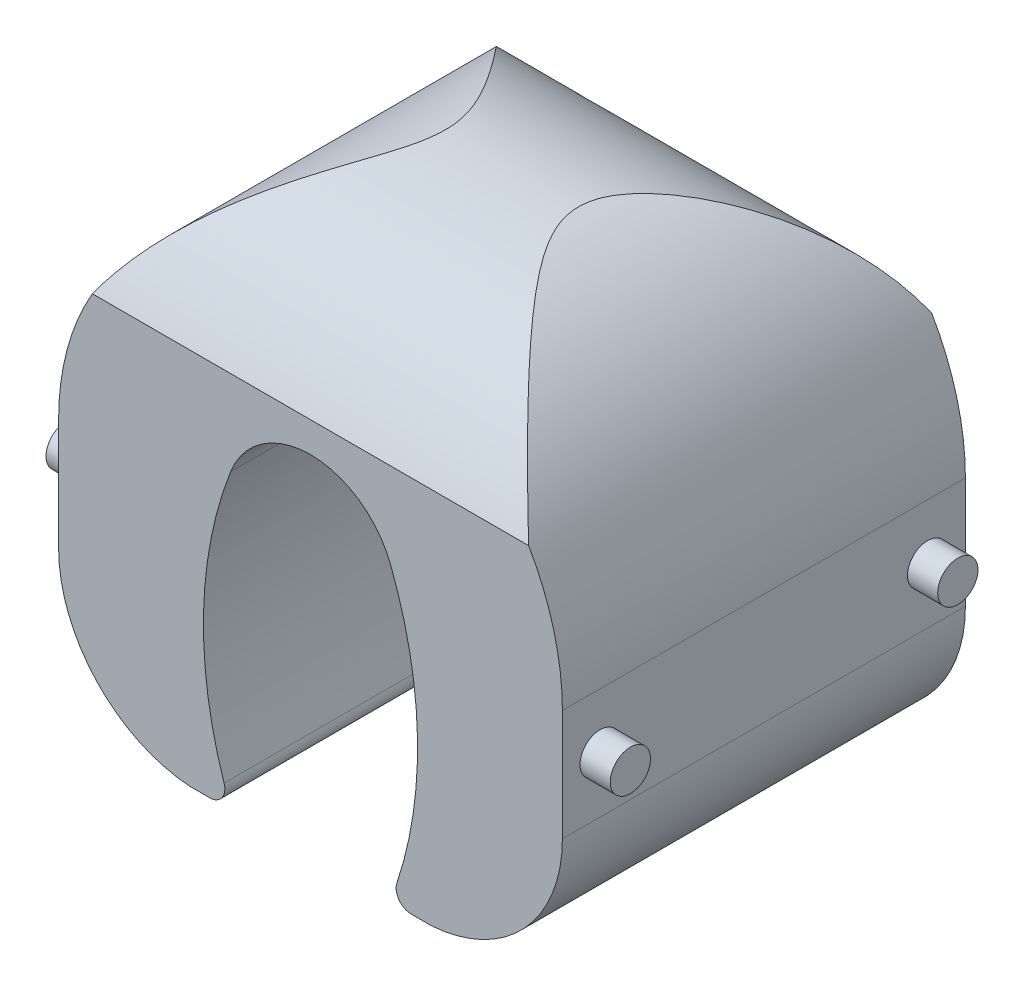
ISO-10303-21;
HEADER;
FILE_DESCRIPTION(('STEP AP214'),'2;1');
FILE_NAME('part.step','',(''),(''),'','','');
FILE_SCHEMA(('AUTOMOTIVE_DESIGN { 1 0 10303 214 1 1 1 1 }'));
ENDSEC;
DATA;
#1=APPLICATION_CONTEXT('core data for automotive mechanical design processes');
#2=APPLICATION_PROTOCOL_DEFINITION('international standard','automotive_design',2000,#1);
#3=PRODUCT_CONTEXT('',#1,'mechanical');
#4=PRODUCT('Part','Part','',(#3));
#5=PRODUCT_RELATED_PRODUCT_CATEGORY('part','',(#4));
#6=PRODUCT_DEFINITION_FORMATION('','',#4);
#7=PRODUCT_DEFINITION_CONTEXT('part definition',#1,'design');
#8=PRODUCT_DEFINITION('design','',#6,#7);
#9=PRODUCT_DEFINITION_SHAPE('','',#8);
#10=(LENGTH_UNIT() NAMED_UNIT(*) SI_UNIT(.MILLI.,.METRE.));
#11=(NAMED_UNIT(*) PLANE_ANGLE_UNIT() SI_UNIT($,.RADIAN.));
#12=(NAMED_UNIT(*) SI_UNIT($,.STERADIAN.) SOLID_ANGLE_UNIT());
#13=UNCERTAINTY_MEASURE_WITH_UNIT(LENGTH_MEASURE(1.E-05),#10,'distance_accuracy_value','');
#14=(GEOMETRIC_REPRESENTATION_CONTEXT(3) GLOBAL_UNCERTAINTY_ASSIGNED_CONTEXT((#13)) GLOBAL_UNIT_ASSIGNED_CONTEXT((#10,
#11,#12)) REPRESENTATION_CONTEXT('',''));
#15=CARTESIAN_POINT('',(0.,0.,0.));
#16=DIRECTION('',(0.,0.,1.));
#17=DIRECTION('',(1.,0.,0.));
#18=AXIS2_PLACEMENT_3D('',#15,#16,#17);
#19=CARTESIAN_POINT('',(0.,0.,-35.3553390593274));
#20=DIRECTION('',(0.,0.,1.));
#21=DIRECTION('',(1.,0.,0.));
#22=AXIS2_PLACEMENT_3D('',#19,#20,#21);
#23=CYLINDRICAL_SURFACE('',#22,25.);
#24=CARTESIAN_POINT('',(-21.650635094611,12.5,10.));
#25=CARTESIAN_POINT('',(-21.4703918887027,12.8122004030975,10.1679854247667));
#26=CARTESIAN_POINT('',(-21.2848264414583,13.1180055209978,10.342044413657));
#27=CARTESIAN_POINT('',(-20.9043958275241,13.7161056991821,10.7012859084175));
#28=CARTESIAN_POINT('',(-20.7095474527227,14.0084234018644,10.8864484751205));
#29=CARTESIAN_POINT('',(-20.3114243463407,14.5796837879489,11.2673071757743));
#30=CARTESIAN_POINT('',(-20.1081567166653,14.8586373326348,11.4629944717703));
#31=CARTESIAN_POINT('',(-19.6940313805674,15.4033160524038,11.8643222319061));
#32=CARTESIAN_POINT('',(-19.4831751193713,15.6690437235739,12.0699608034068));
#33=CARTESIAN_POINT('',(-19.0555450520767,16.1863647516528,12.4897826751679));
#34=CARTESIAN_POINT('',(-18.8387965942422,16.4380076864003,12.7039307822817));
#35=CARTESIAN_POINT('',(-18.3993892832232,16.9284052548925,13.1409722554456));
#36=CARTESIAN_POINT('',(-18.1767284439242,17.1671554738166,13.36386857257));
#37=CARTESIAN_POINT('',(-17.7263012157471,17.6318741285196,13.8178535965159));
#38=CARTESIAN_POINT('',(-17.4985334575103,17.8578390774432,14.0489445105173));
#39=CARTESIAN_POINT('',(-17.03871013725,18.2970887315882,14.5187715456033));
#40=CARTESIAN_POINT('',(-16.8066545293914,18.5103733011589,14.7575077484328));
#41=CARTESIAN_POINT('',(-16.2850388066385,18.9722229104713,15.2981079155009));
#42=CARTESIAN_POINT('',(-15.9945604410971,19.2175788516989,15.6018317271138));
#43=CARTESIAN_POINT('',(-15.4095501614137,19.6897705474217,16.2195543675952));
#44=CARTESIAN_POINT('',(-15.1150183002954,19.916606543908,16.5335530621318));
#45=CARTESIAN_POINT('',(-14.5231444741685,20.352231375241,17.1714610972733));
#46=CARTESIAN_POINT('',(-14.2258017546422,20.5610152024196,17.4953731543191));
#47=CARTESIAN_POINT('',(-13.6296829202574,20.9609304834307,18.1529011820612));
#48=CARTESIAN_POINT('',(-13.3309062956463,21.1520550810181,18.4865208562145));
#49=CARTESIAN_POINT('',(-12.7334517516285,21.5170114612812,19.163535537655));
#50=CARTESIAN_POINT('',(-12.4347739661515,21.690834122768,19.5069355795329));
#51=CARTESIAN_POINT('',(-11.8396264225496,22.0213322131252,20.2036187342451));
#52=CARTESIAN_POINT('',(-11.5431562409427,22.1780110140059,20.5568998863466));
#53=CARTESIAN_POINT('',(-10.9549209717684,22.474385583312,21.2740088675354));
#54=CARTESIAN_POINT('',(-10.663153262064,22.6140911218973,21.6378304785029));
#55=CARTESIAN_POINT('',(-10.231544981014,22.8109738078923,22.192537588075));
#56=CARTESIAN_POINT('',(-10.0887220907965,22.8744726865351,22.3788820662297));
#57=CARTESIAN_POINT('',(-9.80562711684787,22.9972492083998,22.7548664342805));
#58=CARTESIAN_POINT('',(-9.6653549576173,23.0565269767146,22.9445062263121));
#59=CARTESIAN_POINT('',(-9.33691362873108,23.1918981193467,23.3979610558075));
#60=CARTESIAN_POINT('',(-9.15014593432764,23.2661368144741,23.6633537405048));
#61=CARTESIAN_POINT('',(-8.78489185634464,23.4064934890057,24.2019352793417));
#62=CARTESIAN_POINT('',(-8.60640594500262,23.4726110056835,24.4751245766228));
#63=CARTESIAN_POINT('',(-8.26109111771411,23.5963548095124,25.0302761520533));
#64=CARTESIAN_POINT('',(-8.09424990031954,23.6539901308802,25.3122287031035));
#65=CARTESIAN_POINT('',(-7.77650340737462,23.7603451432342,25.8866370211786));
#66=CARTESIAN_POINT('',(-7.62559259699331,23.8090679351135,26.1790890926296));
#67=CARTESIAN_POINT('',(-7.39306884914248,23.8820442533476,26.675442980822));
#68=CARTESIAN_POINT('',(-7.30522751583686,23.9090140854946,26.8760190079123));
#69=CARTESIAN_POINT('',(-7.14167969006547,23.9583743142906,27.2827185563825));
#70=CARTESIAN_POINT('',(-7.06597565101058,23.9807637853254,27.4888431895381));
#71=CARTESIAN_POINT('',(-6.92961076346065,24.0205232899096,27.905944094508));
#72=CARTESIAN_POINT('',(-6.8689115245215,24.037906152329,28.1169064435606));
#73=CARTESIAN_POINT('',(-6.7651815848111,24.067306716289,28.5434214058895));
#74=CARTESIAN_POINT('',(-6.72213708903898,24.0793286074097,28.7589702962803));
#75=CARTESIAN_POINT('',(-6.66677972166271,24.0947000979095,29.1232883693034));
#76=CARTESIAN_POINT('',(-6.64903295077554,24.0995961122563,29.2711792952149));
#77=CARTESIAN_POINT('',(-6.62327901514955,24.1066870371467,29.5679023072381));
#78=CARTESIAN_POINT('',(-6.61527279621822,24.1088816853879,29.716734483335));
#79=CARTESIAN_POINT('',(-6.60926827480034,24.1105284464378,30.0145819627366));
#80=CARTESIAN_POINT('',(-6.61126771425774,24.1099811780365,30.163597217136));
#81=CARTESIAN_POINT('',(-6.62520639948135,24.1061546380479,30.4612201479508));
#82=CARTESIAN_POINT('',(-6.63715215020732,24.1028735785404,30.6098274937599));
#83=CARTESIAN_POINT('',(-6.67061882716562,24.093632846852,30.9059012379284));
#84=CARTESIAN_POINT('',(-6.69214182545653,24.0876725950191,31.0533673823584));
#85=CARTESIAN_POINT('',(-6.74412651410241,24.0731693111059,31.346572175449));
#86=CARTESIAN_POINT('',(-6.77458873237057,24.0646261264875,31.4923107215558));
#87=CARTESIAN_POINT('',(-6.87198975398278,24.0370554551266,31.9002719019654));
#88=CARTESIAN_POINT('',(-6.94836323598122,24.0151735321961,32.160077583654));
#89=CARTESIAN_POINT('',(-7.12283619094984,23.9640026450687,32.6714317547062));
#90=CARTESIAN_POINT('',(-7.22094432203518,23.9347107283991,32.9229769074622));
#91=CARTESIAN_POINT('',(-7.43448142943973,23.8692482739429,33.4189936782991));
#92=CARTESIAN_POINT('',(-7.54998886441732,23.8330463686048,33.6634269435672));
#93=CARTESIAN_POINT('',(-7.79395153146414,23.7543836221868,34.1445951402686));
#94=CARTESIAN_POINT('',(-7.92240528383555,23.7119234961336,34.3813309474005));
#95=CARTESIAN_POINT('',(-8.15126746077333,23.6340227936245,34.7816343329987));
#96=CARTESIAN_POINT('',(-8.24926986092713,23.6000172615012,34.9468734222186));
#97=CARTESIAN_POINT('',(-8.44946913232335,23.5290832607685,35.2741588904229));
#98=CARTESIAN_POINT('',(-8.55166624534764,23.4921546235582,35.4362050845709));
#99=CARTESIAN_POINT('',(-8.86359886487007,23.3770329497007,35.9182584060899));
#100=CARTESIAN_POINT('',(-9.07851338459997,23.2945587623321,36.2339019815985));
#101=CARTESIAN_POINT('',(-9.51796769199328,23.1184878071047,36.8557139182406));
#102=CARTESIAN_POINT('',(-9.74251834423342,23.0248782618574,37.1618708763069));
#103=CARTESIAN_POINT('',(-10.1981196665355,22.8267406379357,37.7657987339849));
#104=CARTESIAN_POINT('',(-10.4291718490069,22.7222100031568,38.0635676495589));
#105=CARTESIAN_POINT('',(-10.8962885745889,22.5019510003868,38.6524955322818));
#106=CARTESIAN_POINT('',(-11.1323661522503,22.3861897554257,38.9436318111285));
#107=CARTESIAN_POINT('',(-11.6070433616396,22.1437917737761,39.5187618245729));
#108=CARTESIAN_POINT('',(-11.8456405954942,22.0171646807473,39.8027616093276));
#109=CARTESIAN_POINT('',(-12.3242128372817,21.7528956921303,40.3641707608432));
#110=CARTESIAN_POINT('',(-12.5641872208421,21.6152584705892,40.6415828600407));
#111=CARTESIAN_POINT('',(-13.0445884657629,21.3287819521825,41.1901416774371));
#112=CARTESIAN_POINT('',(-13.2850153195066,21.1799428422724,41.4612885001025));
#113=CARTESIAN_POINT('',(-13.8646470920953,20.807075629001,42.1080790349915));
#114=CARTESIAN_POINT('',(-14.2036544081563,20.577373952853,42.4806503793502));
#115=CARTESIAN_POINT('',(-14.8787750975946,20.0946347764815,43.2133177049096));
#116=CARTESIAN_POINT('',(-15.214887644119,19.8415908357412,43.5734102050614));
#117=CARTESIAN_POINT('',(-15.8822419170561,19.3115512229187,44.280501674385));
#118=CARTESIAN_POINT('',(-16.2134823651142,19.034549391392,44.6274972432732));
#119=CARTESIAN_POINT('',(-16.8674034606368,18.4575164036212,45.3056635058732));
#120=CARTESIAN_POINT('',(-17.1901186525971,18.1576074494056,45.6369047114865));
#121=CARTESIAN_POINT('',(-17.8266551978411,17.5330853028519,46.2841624818673));
#122=CARTESIAN_POINT('',(-18.1404785554622,17.2084777396951,46.6001824891189));
#123=CARTESIAN_POINT('',(-18.7570007695802,16.534314370914,47.2154669536528));
#124=CARTESIAN_POINT('',(-19.059705444701,16.1847719043322,47.5147402190261));
#125=CARTESIAN_POINT('',(-19.767789615777,15.3185437730352,48.2086676375781));
#126=CARTESIAN_POINT('',(-20.1670613000592,14.7899244077552,48.59488747896));
#127=CARTESIAN_POINT('',(-20.7422488157644,13.959693540469,49.1446611549998));
#128=CARTESIAN_POINT('',(-20.9303060745223,13.6762500420653,49.3232546398173));
#129=CARTESIAN_POINT('',(-21.2974339565751,13.0972064374575,49.669779000776));
#130=CARTESIAN_POINT('',(-21.4765030730937,12.8016043079873,49.8377080903761));
#131=CARTESIAN_POINT('',(-21.6506350946109,12.5,50.));
#132=B_SPLINE_CURVE_WITH_KNOTS('',3,(#24,#25,#26,#27,#28,#29,#30,#31,#32,#33,#34,#35,#36,#37,
#38,#39,#40,#41,#42,#43,#44,#45,#46,#47,#48,#49,#50,#51,#52,#53,#54,#55,#56,#57,#58,#59,#60,#61,
#62,#63,#64,#65,#66,#67,#68,#69,#70,#71,#72,#73,#74,#75,#76,#77,#78,#79,#80,#81,#82,#83,#84,#85,
#86,#87,#88,#89,#90,#91,#92,#93,#94,#95,#96,#97,#98,#99,#100,#101,#102,#103,#104,#105,#106,#107,
#108,#109,#110,#111,#112,#113,#114,#115,#116,#117,#118,#119,#120,#121,#122,#123,#124,#125,#126,
#127,#128,#129,#130,#131),.UNSPECIFIED.,.F.,.F.,(4,2,2,2,2,2,2,2,2,2,2,2,2,2,2,2,2,2,2,2,2,2,2,
2,2,2,2,2,2,2,2,2,2,2,2,2,2,2,2,2,2,2,2,2,2,2,2,2,2,2,2,2,2,4),(0.,1.19294408488821,
2.38380662307588,3.57368431171742,4.76333657945521,5.94849716558415,7.1340610428383,
8.31994670906994,9.50584505924323,10.9652694174802,12.4246747030782,13.8844835371932,
15.3448567852579,16.805995876284,18.2668470586163,19.7268533202357,20.456446140872,
21.1860173309391,22.1844835110307,23.1830065551117,24.1804582735959,25.1775622907189,
25.8390676582252,26.5007065731094,27.1606347148178,27.8200462173023,28.2668314611608,
28.7136600843996,29.1603878728372,29.6074080541887,30.054524996399,30.5016683487935,
31.3152476282979,32.12915158615,32.9468420858645,33.7644392334973,34.3496508512963,
34.9348962479991,36.1063658039158,37.2791927826692,38.4522948816608,39.6289412119304,
40.8045538371358,41.9796700102416,43.1547665754334,44.8149845847803,46.4756620537792,
48.1367677503842,49.7895595257119,51.4419757270547,53.0935144954534,55.390507529612,
56.5426921094912,57.6950692014028),.UNSPECIFIED.);
#133=CARTESIAN_POINT('',(-21.650635094611,12.5,10.));
#134=VERTEX_POINT('',#133);
#135=CARTESIAN_POINT('',(-21.650635094611,12.5,50.));
#136=VERTEX_POINT('',#135);
#137=EDGE_CURVE('E302',#134,#136,#132,.T.);
#138=ORIENTED_EDGE('',*,*,#137,.F.);
#139=CARTESIAN_POINT('',(0.,0.,10.));
#140=DIRECTION('',(0.,0.,-1.));
#141=DIRECTION('',(-1.,0.,0.));
#142=AXIS2_PLACEMENT_3D('',#139,#140,#141);
#143=CIRCLE('',#142,25.);
#144=CARTESIAN_POINT('',(-25.,0.,10.));
#145=VERTEX_POINT('',#144);
#146=EDGE_CURVE('E273',#145,#134,#143,.T.);
#147=ORIENTED_EDGE('',*,*,#146,.F.);
#148=DIRECTION('',(0.,0.,1.));
#149=VECTOR('',#148,1.);
#150=CARTESIAN_POINT('',(-25.,0.,-35.3553390593274));
#151=LINE('',#150,#149);
#152=CARTESIAN_POINT('',(-25.,0.,50.));
#153=VERTEX_POINT('',#152);
#154=EDGE_CURVE('E213',#145,#153,#151,.T.);
#155=ORIENTED_EDGE('',*,*,#154,.T.);
#156=CARTESIAN_POINT('',(0.,0.,50.));
#157=DIRECTION('',(0.,0.,1.));
#158=DIRECTION('',(1.,0.,0.));
#159=AXIS2_PLACEMENT_3D('',#156,#157,#158);
#160=CIRCLE('',#159,25.);
#161=EDGE_CURVE('E294',#136,#153,#160,.T.);
#162=ORIENTED_EDGE('',*,*,#161,.F.);
#163=EDGE_LOOP('',(#138,#147,#155,#162));
#164=FACE_BOUND('',#163,.T.);
#165=ADVANCED_FACE('F65',(#164),#23,.T.);
#166=CARTESIAN_POINT('',(21.650635094611,12.5,10.));
#167=CARTESIAN_POINT('',(21.4703918887027,12.8122004030975,10.1679854247667));
#168=CARTESIAN_POINT('',(21.2848264414583,13.1180055209978,10.342044413657));
#169=CARTESIAN_POINT('',(20.9043958275241,13.7161056991821,10.7012859084175));
#170=CARTESIAN_POINT('',(20.7095474527227,14.0084234018644,10.8864484751205));
#171=CARTESIAN_POINT('',(20.3114243463407,14.5796837879489,11.2673071757743));
#172=CARTESIAN_POINT('',(20.1081567166653,14.8586373326348,11.4629944717703));
#173=CARTESIAN_POINT('',(19.6940313805674,15.4033160524038,11.8643222319061));
#174=CARTESIAN_POINT('',(19.4831751193713,15.6690437235739,12.0699608034068));
#175=CARTESIAN_POINT('',(19.0555450520767,16.1863647516528,12.4897826751679));
#176=CARTESIAN_POINT('',(18.8387965942422,16.4380076864003,12.7039307822817));
#177=CARTESIAN_POINT('',(18.3993892832232,16.9284052548925,13.1409722554456));
#178=CARTESIAN_POINT('',(18.1767284439242,17.1671554738166,13.36386857257));
#179=CARTESIAN_POINT('',(17.7263012157471,17.6318741285196,13.8178535965159));
#180=CARTESIAN_POINT('',(17.4985334575103,17.8578390774432,14.0489445105173));
#181=CARTESIAN_POINT('',(17.0387101372501,18.2970887315882,14.5187715456033));
#182=CARTESIAN_POINT('',(16.8066545293914,18.5103733011589,14.7575077484328));
#183=CARTESIAN_POINT('',(16.2850388066385,18.9722229104713,15.2981079155009));
#184=CARTESIAN_POINT('',(15.9945604410971,19.2175788516989,15.6018317271138));
#185=CARTESIAN_POINT('',(15.4095501614137,19.6897705474217,16.2195543675952));
#186=CARTESIAN_POINT('',(15.1150183002954,19.916606543908,16.5335530621318));
#187=CARTESIAN_POINT('',(14.5231444741685,20.352231375241,17.1714610972733));
#188=CARTESIAN_POINT('',(14.2258017546422,20.5610152024196,17.4953731543191));
#189=CARTESIAN_POINT('',(13.6296829202574,20.9609304834307,18.1529011820612));
#190=CARTESIAN_POINT('',(13.3309062956463,21.1520550810181,18.4865208562145));
#191=CARTESIAN_POINT('',(12.7334517516285,21.5170114612812,19.163535537655));
#192=CARTESIAN_POINT('',(12.4347739661515,21.690834122768,19.5069355795329));
#193=CARTESIAN_POINT('',(11.8396264225496,22.0213322131252,20.2036187342451));
#194=CARTESIAN_POINT('',(11.5431562409427,22.1780110140059,20.5568998863466));
#195=CARTESIAN_POINT('',(10.9549209717684,22.474385583312,21.2740088675354));
#196=CARTESIAN_POINT('',(10.663153262064,22.6140911218973,21.6378304785029));
#197=CARTESIAN_POINT('',(10.2315449810141,22.8109738078923,22.192537588075));
#198=CARTESIAN_POINT('',(10.0887220907966,22.8744726865351,22.3788820662297));
#199=CARTESIAN_POINT('',(9.80562711684789,22.9972492083998,22.7548664342805));
#200=CARTESIAN_POINT('',(9.66535495761731,23.0565269767146,22.9445062263121));
#201=CARTESIAN_POINT('',(9.33691362873109,23.1918981193467,23.3979610558075));
#202=CARTESIAN_POINT('',(9.15014593432765,23.266136814474,23.6633537405048));
#203=CARTESIAN_POINT('',(8.78489185634465,23.4064934890057,24.2019352793416));
#204=CARTESIAN_POINT('',(8.60640594500264,23.4726110056835,24.4751245766228));
#205=CARTESIAN_POINT('',(8.26109111771413,23.5963548095124,25.0302761520532));
#206=CARTESIAN_POINT('',(8.09424990031956,23.6539901308802,25.3122287031035));
#207=CARTESIAN_POINT('',(7.77650340737465,23.7603451432342,25.8866370211786));
#208=CARTESIAN_POINT('',(7.62559259699334,23.8090679351135,26.1790890926296));
#209=CARTESIAN_POINT('',(7.39306884914251,23.8820442533476,26.675442980822));
#210=CARTESIAN_POINT('',(7.30522751583689,23.9090140854946,26.8760190079123));
#211=CARTESIAN_POINT('',(7.14167969006549,23.9583743142906,27.2827185563825));
#212=CARTESIAN_POINT('',(7.0659756510106,23.9807637853254,27.4888431895381));
#213=CARTESIAN_POINT('',(6.92961076346066,24.0205232899096,27.905944094508));
#214=CARTESIAN_POINT('',(6.86891152452151,24.037906152329,28.1169064435605));
#215=CARTESIAN_POINT('',(6.76518158481112,24.067306716289,28.5434214058894));
#216=CARTESIAN_POINT('',(6.72213708903899,24.0793286074097,28.7589702962803));
#217=CARTESIAN_POINT('',(6.66677972166272,24.0947000979095,29.1232883693033));
#218=CARTESIAN_POINT('',(6.64903295077555,24.0995961122563,29.2711792952148));
#219=CARTESIAN_POINT('',(6.62327901514956,24.1066870371467,29.5679023072381));
#220=CARTESIAN_POINT('',(6.61527279621822,24.1088816853879,29.716734483335));
#221=CARTESIAN_POINT('',(6.60926827480035,24.1105284464378,30.0145819627366));
#222=CARTESIAN_POINT('',(6.61126771425777,24.1099811780365,30.1635972171359));
#223=CARTESIAN_POINT('',(6.62520639948137,24.1061546380479,30.4612201479508));
#224=CARTESIAN_POINT('',(6.63715215020732,24.1028735785404,30.6098274937598));
#225=CARTESIAN_POINT('',(6.67061882716561,24.093632846852,30.9059012379283));
#226=CARTESIAN_POINT('',(6.69214182545654,24.0876725950191,31.0533673823583));
#227=CARTESIAN_POINT('',(6.74412651410241,24.0731693111059,31.3465721754489));
#228=CARTESIAN_POINT('',(6.77458873237054,24.0646261264875,31.4923107215557));
#229=CARTESIAN_POINT('',(6.87198975398272,24.0370554551266,31.9002719019653));
#230=CARTESIAN_POINT('',(6.94836323598121,24.0151735321961,32.1600775836539));
#231=CARTESIAN_POINT('',(7.12283619094985,23.9640026450687,32.6714317547061));
#232=CARTESIAN_POINT('',(7.22094432203517,23.9347107283991,32.9229769074621));
#233=CARTESIAN_POINT('',(7.4344814294397,23.8692482739429,33.4189936782991));
#234=CARTESIAN_POINT('',(7.54998886441729,23.8330463686048,33.6634269435671));
#235=CARTESIAN_POINT('',(7.79395153146411,23.7543836221868,34.1445951402685));
#236=CARTESIAN_POINT('',(7.92240528383551,23.7119234961336,34.3813309474005));
#237=CARTESIAN_POINT('',(8.15126746077329,23.6340227936245,34.7816343329987));
#238=CARTESIAN_POINT('',(8.24926986092709,23.6000172615012,34.9468734222186));
#239=CARTESIAN_POINT('',(8.44946913232332,23.5290832607685,35.2741588904229));
#240=CARTESIAN_POINT('',(8.55166624534762,23.4921546235582,35.4362050845708));
#241=CARTESIAN_POINT('',(8.86359886487004,23.3770329497008,35.9182584060898));
#242=CARTESIAN_POINT('',(9.07851338459993,23.2945587623321,36.2339019815984));
#243=CARTESIAN_POINT('',(9.51796769199323,23.1184878071047,36.8557139182405));
#244=CARTESIAN_POINT('',(9.74251834423336,23.0248782618574,37.1618708763069));
#245=CARTESIAN_POINT('',(10.1981196665355,22.8267406379357,37.7657987339849));
#246=CARTESIAN_POINT('',(10.4291718490069,22.7222100031568,38.0635676495588));
#247=CARTESIAN_POINT('',(10.8962885745889,22.5019510003868,38.6524955322817));
#248=CARTESIAN_POINT('',(11.1323661522503,22.3861897554258,38.9436318111284));
#249=CARTESIAN_POINT('',(11.6070433616396,22.1437917737761,39.5187618245728));
#250=CARTESIAN_POINT('',(11.8456405954942,22.0171646807474,39.8027616093275));
#251=CARTESIAN_POINT('',(12.3242128372816,21.7528956921303,40.3641707608432));
#252=CARTESIAN_POINT('',(12.564187220842,21.6152584705892,40.6415828600406));
#253=CARTESIAN_POINT('',(13.0445884657629,21.3287819521826,41.190141677437));
#254=CARTESIAN_POINT('',(13.2850153195066,21.1799428422724,41.4612885001024));
#255=CARTESIAN_POINT('',(13.8646470920953,20.8070756290011,42.1080790349914));
#256=CARTESIAN_POINT('',(14.2036544081563,20.577373952853,42.4806503793501));
#257=CARTESIAN_POINT('',(14.8787750975945,20.0946347764816,43.2133177049095));
#258=CARTESIAN_POINT('',(15.2148876441189,19.8415908357413,43.5734102050614));
#259=CARTESIAN_POINT('',(15.882241917056,19.3115512229187,44.280501674385));
#260=CARTESIAN_POINT('',(16.2134823651141,19.0345493913921,44.6274972432731));
#261=CARTESIAN_POINT('',(16.8674034606367,18.4575164036213,45.3056635058731));
#262=CARTESIAN_POINT('',(17.1901186525971,18.1576074494057,45.6369047114864));
#263=CARTESIAN_POINT('',(17.826655197841,17.533085302852,46.2841624818672));
#264=CARTESIAN_POINT('',(18.1404785554621,17.2084777396952,46.6001824891188));
#265=CARTESIAN_POINT('',(18.7570007695801,16.5343143709142,47.2154669536527));
#266=CARTESIAN_POINT('',(19.0597054447009,16.1847719043323,47.514740219026));
#267=CARTESIAN_POINT('',(19.7677896157769,15.3185437730353,48.2086676375781));
#268=CARTESIAN_POINT('',(20.1670613000591,14.7899244077553,48.5948874789599));
#269=CARTESIAN_POINT('',(20.7422488157643,13.9596935404691,49.1446611549998));
#270=CARTESIAN_POINT('',(20.9303060745222,13.6762500420653,49.3232546398173));
#271=CARTESIAN_POINT('',(21.2974339565751,13.0972064374575,49.669779000776));
#272=CARTESIAN_POINT('',(21.4765030730937,12.8016043079873,49.8377080903761));
#273=CARTESIAN_POINT('',(21.6506350946109,12.5,50.));
#274=B_SPLINE_CURVE_WITH_KNOTS('',3,(#166,#167,#168,#169,#170,#171,#172,#173,#174,#175,#176,
#177,#178,#179,#180,#181,#182,#183,#184,#185,#186,#187,#188,#189,#190,#191,#192,#193,#194,#195,
#196,#197,#198,#199,#200,#201,#202,#203,#204,#205,#206,#207,#208,#209,#210,#211,#212,#213,#214,
#215,#216,#217,#218,#219,#220,#221,#222,#223,#224,#225,#226,#227,#228,#229,#230,#231,#232,#233,
#234,#235,#236,#237,#238,#239,#240,#241,#242,#243,#244,#245,#246,#247,#248,#249,#250,#251,#252,
#253,#254,#255,#256,#257,#258,#259,#260,#261,#262,#263,#264,#265,#266,#267,#268,#269,#270,#271,
#272,#273),.UNSPECIFIED.,.F.,.F.,(4,2,2,2,2,2,2,2,2,2,2,2,2,2,2,2,2,2,2,2,2,2,2,2,2,2,2,2,2,2,2,
2,2,2,2,2,2,2,2,2,2,2,2,2,2,2,2,2,2,2,2,2,2,4),(0.,1.19294408488821,2.38380662307588,
3.57368431171741,4.7633365794552,5.94849716558414,7.1340610428383,8.31994670906994,
9.50584505924323,10.9652694174802,12.4246747030782,13.8844835371932,15.3448567852579,
16.805995876284,18.2668470586163,19.7268533202357,20.4564461408719,21.1860173309391,
22.1844835110307,23.1830065551117,24.1804582735959,25.1775622907188,25.8390676582252,
26.5007065731094,27.1606347148178,27.8200462173022,28.2668314611608,28.7136600843996,
29.1603878728371,29.6074080541887,30.054524996399,30.5016683487934,31.3152476282979,
32.1291515861499,32.9468420858645,33.7644392334972,34.3496508512963,34.934896247999,
36.1063658039157,37.2791927826691,38.4522948816607,39.6289412119303,40.8045538371357,
41.9796700102415,43.1547665754332,44.8149845847801,46.4756620537791,48.136767750384,
49.7895595257117,51.4419757270545,53.0935144954532,55.3905075296119,56.5426921094912,
57.6950692014028),.UNSPECIFIED.);
#275=CARTESIAN_POINT('',(21.650635094611,12.5,10.));
#276=VERTEX_POINT('',#275);
#277=CARTESIAN_POINT('',(21.650635094611,12.5,50.));
#278=VERTEX_POINT('',#277);
#279=EDGE_CURVE('E80',#276,#278,#274,.T.);
#280=ORIENTED_EDGE('',*,*,#279,.T.);
#281=CARTESIAN_POINT('',(25.,0.,50.));
#282=VERTEX_POINT('',#281);
#283=EDGE_CURVE('E256',#282,#278,#160,.T.);
#284=ORIENTED_EDGE('',*,*,#283,.F.);
#285=DIRECTION('',(0.,0.,1.));
#286=VECTOR('',#285,1.);
#287=CARTESIAN_POINT('',(25.,0.,-35.3553390593274));
#288=LINE('',#287,#286);
#289=CARTESIAN_POINT('',(25.,0.,10.));
#290=VERTEX_POINT('',#289);
#291=EDGE_CURVE('E210',#290,#282,#288,.T.);
#292=ORIENTED_EDGE('',*,*,#291,.F.);
#293=EDGE_CURVE('E241',#276,#290,#143,.T.);
#294=ORIENTED_EDGE('',*,*,#293,.F.);
#295=EDGE_LOOP('',(#280,#284,#292,#294));
#296=FACE_BOUND('',#295,.T.);
#297=ADVANCED_FACE('F309',(#296),#23,.T.);
#298=CARTESIAN_POINT('',(0.,0.,50.));
#299=DIRECTION('',(0.,0.,1.));
#300=DIRECTION('',(1.,0.,0.));
#301=AXIS2_PLACEMENT_3D('',#298,#299,#300);
#302=PLANE('',#301);
#303=CARTESIAN_POINT('',(0.,1.,50.));
#304=DIRECTION('',(0.,0.,1.));
#305=DIRECTION('',(1.,0.,0.));
#306=AXIS2_PLACEMENT_3D('',#303,#304,#305);
#307=CIRCLE('',#306,8.5);
#308=CARTESIAN_POINT('',(7.92577262040183,4.07117703327057,50.));
#309=VERTEX_POINT('',#308);
#310=CARTESIAN_POINT('',(-7.92577262040184,4.07117703327057,50.));
#311=VERTEX_POINT('',#310);
#312=EDGE_CURVE('E172',#309,#311,#307,.T.);
#313=ORIENTED_EDGE('',*,*,#312,.F.);
#314=CARTESIAN_POINT('',(-29.3719808873715,-10.3814207703557,50.));
#315=DIRECTION('',(0.,0.,1.));
#316=DIRECTION('',(1.,0.,0.));
#317=AXIS2_PLACEMENT_3D('',#314,#315,#316);
#318=CIRCLE('',#317,40.);
#319=CARTESIAN_POINT('',(8.5769163534685,-23.0258344856755,50.));
#320=VERTEX_POINT('',#319);
#321=EDGE_CURVE('E293',#309,#320,#318,.F.);
#322=ORIENTED_EDGE('',*,*,#321,.T.);
#323=CARTESIAN_POINT('',(10.,-23.5,50.));
#324=DIRECTION('',(0.,0.,1.));
#325=DIRECTION('',(1.,0.,0.));
#326=AXIS2_PLACEMENT_3D('',#323,#324,#325);
#327=CIRCLE('',#326,1.5);
#328=CARTESIAN_POINT('',(9.99999999999999,-25.,50.));
#329=VERTEX_POINT('',#328);
#330=EDGE_CURVE('E290',#320,#329,#327,.T.);
#331=ORIENTED_EDGE('',*,*,#330,.T.);
#332=DIRECTION('',(1.,0.,0.));
#333=VECTOR('',#332,1.);
#334=CARTESIAN_POINT('',(-25.,-25.,50.));
#335=LINE('',#334,#333);
#336=CARTESIAN_POINT('',(12.,-25.,50.));
#337=VERTEX_POINT('',#336);
#338=EDGE_CURVE('E287',#329,#337,#335,.T.);
#339=ORIENTED_EDGE('',*,*,#338,.T.);
#340=CARTESIAN_POINT('',(11.,-11.0357599562311,50.));
#341=DIRECTION('',(0.,0.,1.));
#342=DIRECTION('',(1.,0.,0.));
#343=AXIS2_PLACEMENT_3D('',#340,#341,#342);
#344=CIRCLE('',#343,14.);
#345=CARTESIAN_POINT('',(25.,-11.0357599562311,50.));
#346=VERTEX_POINT('',#345);
#347=EDGE_CURVE('E216',#337,#346,#344,.T.);
#348=ORIENTED_EDGE('',*,*,#347,.T.);
#349=DIRECTION('',(0.,1.,0.));
#350=VECTOR('',#349,1.);
#351=CARTESIAN_POINT('',(25.,-25.,50.));
#352=LINE('',#351,#350);
#353=EDGE_CURVE('E284',#346,#282,#352,.T.);
#354=ORIENTED_EDGE('',*,*,#353,.T.);
#355=ORIENTED_EDGE('',*,*,#283,.T.);
#356=DIRECTION('',(-1.,0.,0.));
#357=VECTOR('',#356,1.);
#358=CARTESIAN_POINT('',(48.0456403483627,12.5,50.));
#359=LINE('',#358,#357);
#360=EDGE_CURVE('E299',#278,#136,#359,.T.);
#361=ORIENTED_EDGE('',*,*,#360,.T.);
#362=ORIENTED_EDGE('',*,*,#161,.T.);
#363=DIRECTION('',(0.,-1.,0.));
#364=VECTOR('',#363,1.);
#365=CARTESIAN_POINT('',(-25.,-25.,50.));
#366=LINE('',#365,#364);
#367=CARTESIAN_POINT('',(-25.,-11.0357599562311,50.));
#368=VERTEX_POINT('',#367);
#369=EDGE_CURVE('E253',#153,#368,#366,.T.);
#370=ORIENTED_EDGE('',*,*,#369,.T.);
#371=CARTESIAN_POINT('',(-11.,-11.0357599562311,50.));
#372=DIRECTION('',(0.,0.,1.));
#373=DIRECTION('',(1.,0.,0.));
#374=AXIS2_PLACEMENT_3D('',#371,#372,#373);
#375=CIRCLE('',#374,14.);
#376=CARTESIAN_POINT('',(-12.,-25.,50.));
#377=VERTEX_POINT('',#376);
#378=EDGE_CURVE('E250',#377,#368,#375,.F.);
#379=ORIENTED_EDGE('',*,*,#378,.F.);
#380=DIRECTION('',(1.,0.,0.));
#381=VECTOR('',#380,1.);
#382=CARTESIAN_POINT('',(-25.,-25.,50.));
#383=LINE('',#382,#381);
#384=CARTESIAN_POINT('',(-10.,-25.,50.));
#385=VERTEX_POINT('',#384);
#386=EDGE_CURVE('E252',#377,#385,#383,.T.);
#387=ORIENTED_EDGE('',*,*,#386,.T.);
#388=CARTESIAN_POINT('',(-10.,-23.5,50.));
#389=DIRECTION('',(0.,0.,1.));
#390=DIRECTION('',(1.,0.,0.));
#391=AXIS2_PLACEMENT_3D('',#388,#389,#390);
#392=CIRCLE('',#391,1.5);
#393=CARTESIAN_POINT('',(-8.5769163534685,-23.0258344856755,50.));
#394=VERTEX_POINT('',#393);
#395=EDGE_CURVE('E175',#394,#385,#392,.F.);
#396=ORIENTED_EDGE('',*,*,#395,.F.);
#397=CARTESIAN_POINT('',(29.3719808873715,-10.3814207703557,50.));
#398=DIRECTION('',(0.,0.,1.));
#399=DIRECTION('',(1.,0.,0.));
#400=AXIS2_PLACEMENT_3D('',#397,#398,#399);
#401=CIRCLE('',#400,40.);
#402=EDGE_CURVE('E167',#311,#394,#401,.T.);
#403=ORIENTED_EDGE('',*,*,#402,.F.);
#404=EDGE_LOOP('',(#313,#322,#331,#339,#348,#354,#355,#361,#362,#370,#379,#387,#396,#403));
#405=FACE_BOUND('',#404,.T.);
#406=ADVANCED_FACE('F169',(#405),#302,.T.);
#407=CARTESIAN_POINT('',(0.,0.,10.));
#408=DIRECTION('',(0.,0.,-1.));
#409=DIRECTION('',(-1.,0.,0.));
#410=AXIS2_PLACEMENT_3D('',#407,#408,#409);
#411=PLANE('',#410);
#412=CARTESIAN_POINT('',(0.,1.,10.));
#413=DIRECTION('',(0.,0.,-1.));
#414=DIRECTION('',(-1.,0.,0.));
#415=AXIS2_PLACEMENT_3D('',#412,#413,#414);
#416=CIRCLE('',#415,8.5);
#417=CARTESIAN_POINT('',(7.92577262040184,4.07117703327058,10.));
#418=VERTEX_POINT('',#417);
#419=CARTESIAN_POINT('',(-7.92577262040183,4.07117703327058,10.));
#420=VERTEX_POINT('',#419);
#421=EDGE_CURVE('E268',#418,#420,#416,.F.);
#422=ORIENTED_EDGE('',*,*,#421,.T.);
#423=CARTESIAN_POINT('',(29.3719808873715,-10.3814207703557,10.));
#424=DIRECTION('',(0.,0.,-1.));
#425=DIRECTION('',(-1.,0.,0.));
#426=AXIS2_PLACEMENT_3D('',#423,#424,#425);
#427=CIRCLE('',#426,40.);
#428=CARTESIAN_POINT('',(-8.5769163534685,-23.0258344856755,10.));
#429=VERTEX_POINT('',#428);
#430=EDGE_CURVE('E183',#420,#429,#427,.F.);
#431=ORIENTED_EDGE('',*,*,#430,.T.);
#432=CARTESIAN_POINT('',(-10.,-23.5,10.));
#433=DIRECTION('',(0.,0.,-1.));
#434=DIRECTION('',(-1.,0.,0.));
#435=AXIS2_PLACEMENT_3D('',#432,#433,#434);
#436=CIRCLE('',#435,1.5);
#437=CARTESIAN_POINT('',(-9.99999999999998,-25.,10.));
#438=VERTEX_POINT('',#437);
#439=EDGE_CURVE('E263',#429,#438,#436,.T.);
#440=ORIENTED_EDGE('',*,*,#439,.T.);
#441=DIRECTION('',(-1.,0.,0.));
#442=VECTOR('',#441,1.);
#443=CARTESIAN_POINT('',(0.,-25.,10.));
#444=LINE('',#443,#442);
#445=CARTESIAN_POINT('',(-12.,-25.,10.));
#446=VERTEX_POINT('',#445);
#447=EDGE_CURVE('E265',#438,#446,#444,.T.);
#448=ORIENTED_EDGE('',*,*,#447,.T.);
#449=CARTESIAN_POINT('',(-11.,-11.0357599562311,10.));
#450=DIRECTION('',(0.,0.,-1.));
#451=DIRECTION('',(-1.,0.,0.));
#452=AXIS2_PLACEMENT_3D('',#449,#450,#451);
#453=CIRCLE('',#452,14.);
#454=CARTESIAN_POINT('',(-25.,-11.0357599562311,10.));
#455=VERTEX_POINT('',#454);
#456=EDGE_CURVE('E242',#446,#455,#453,.T.);
#457=ORIENTED_EDGE('',*,*,#456,.T.);
#458=DIRECTION('',(0.,1.,0.));
#459=VECTOR('',#458,1.);
#460=CARTESIAN_POINT('',(-25.,0.,10.));
#461=LINE('',#460,#459);
#462=EDGE_CURVE('E235',#455,#145,#461,.T.);
#463=ORIENTED_EDGE('',*,*,#462,.T.);
#464=ORIENTED_EDGE('',*,*,#146,.T.);
#465=DIRECTION('',(-1.,0.,0.));
#466=VECTOR('',#465,1.);
#467=CARTESIAN_POINT('',(48.0456403483627,12.5,10.));
#468=LINE('',#467,#466);
#469=EDGE_CURVE('E304',#276,#134,#468,.T.);
#470=ORIENTED_EDGE('',*,*,#469,.F.);
#471=ORIENTED_EDGE('',*,*,#293,.T.);
#472=DIRECTION('',(0.,-1.,0.));
#473=VECTOR('',#472,1.);
#474=CARTESIAN_POINT('',(25.,0.,10.));
#475=LINE('',#474,#473);
#476=CARTESIAN_POINT('',(25.,-11.0357599562311,10.));
#477=VERTEX_POINT('',#476);
#478=EDGE_CURVE('E88',#290,#477,#475,.T.);
#479=ORIENTED_EDGE('',*,*,#478,.T.);
#480=CARTESIAN_POINT('',(11.,-11.0357599562311,10.));
#481=DIRECTION('',(0.,0.,-1.));
#482=DIRECTION('',(-1.,0.,0.));
#483=AXIS2_PLACEMENT_3D('',#480,#481,#482);
#484=CIRCLE('',#483,14.);
#485=CARTESIAN_POINT('',(12.,-25.,10.));
#486=VERTEX_POINT('',#485);
#487=EDGE_CURVE('E276',#477,#486,#484,.T.);
#488=ORIENTED_EDGE('',*,*,#487,.T.);
#489=DIRECTION('',(-1.,0.,0.));
#490=VECTOR('',#489,1.);
#491=CARTESIAN_POINT('',(0.,-25.,10.));
#492=LINE('',#491,#490);
#493=CARTESIAN_POINT('',(9.99999999999999,-25.,10.));
#494=VERTEX_POINT('',#493);
#495=EDGE_CURVE('E278',#486,#494,#492,.T.);
#496=ORIENTED_EDGE('',*,*,#495,.T.);
#497=CARTESIAN_POINT('',(10.,-23.5,10.));
#498=DIRECTION('',(0.,0.,-1.));
#499=DIRECTION('',(-1.,0.,0.));
#500=AXIS2_PLACEMENT_3D('',#497,#498,#499);
#501=CIRCLE('',#500,1.5);
#502=CARTESIAN_POINT('',(8.5769163534685,-23.0258344856755,10.));
#503=VERTEX_POINT('',#502);
#504=EDGE_CURVE('E280',#494,#503,#501,.T.);
#505=ORIENTED_EDGE('',*,*,#504,.T.);
#506=CARTESIAN_POINT('',(-29.3719808873715,-10.3814207703557,10.));
#507=DIRECTION('',(0.,0.,-1.));
#508=DIRECTION('',(-1.,0.,0.));
#509=AXIS2_PLACEMENT_3D('',#506,#507,#508);
#510=CIRCLE('',#509,40.);
#511=EDGE_CURVE('E282',#503,#418,#510,.F.);
#512=ORIENTED_EDGE('',*,*,#511,.T.);
#513=EDGE_LOOP('',(#422,#431,#440,#448,#457,#463,#464,#470,#471,#479,#488,#496,#505,#512));
#514=FACE_BOUND('',#513,.T.);
#515=ADVANCED_FACE('F303',(#514),#411,.T.);
#516=CARTESIAN_POINT('',(-25.,-25.,60.));
#517=DIRECTION('',(0.,1.,0.));
#518=DIRECTION('',(0.,0.,1.));
#519=AXIS2_PLACEMENT_3D('',#516,#517,#518);
#520=PLANE('',#519);
#521=ORIENTED_EDGE('',*,*,#447,.F.);
#522=DIRECTION('',(0.,0.,1.));
#523=VECTOR('',#522,1.);
#524=CARTESIAN_POINT('',(-9.99999999999998,-25.,-40.5224525545232));
#525=LINE('',#524,#523);
#526=EDGE_CURVE('E207',#438,#385,#525,.T.);
#527=ORIENTED_EDGE('',*,*,#526,.T.);
#528=ORIENTED_EDGE('',*,*,#386,.F.);
#529=DIRECTION('',(0.,0.,1.));
#530=VECTOR('',#529,1.);
#531=CARTESIAN_POINT('',(-12.,-25.,-40.5224525545232));
#532=LINE('',#531,#530);
#533=EDGE_CURVE('E198',#446,#377,#532,.T.);
#534=ORIENTED_EDGE('',*,*,#533,.F.);
#535=EDGE_LOOP('',(#521,#527,#528,#534));
#536=FACE_BOUND('',#535,.T.);
#537=ADVANCED_FACE('F355',(#536),#520,.F.);
#538=ORIENTED_EDGE('',*,*,#495,.F.);
#539=DIRECTION('',(0.,0.,1.));
#540=VECTOR('',#539,1.);
#541=CARTESIAN_POINT('',(12.,-25.,-40.5224525545232));
#542=LINE('',#541,#540);
#543=EDGE_CURVE('E192',#486,#337,#542,.T.);
#544=ORIENTED_EDGE('',*,*,#543,.T.);
#545=ORIENTED_EDGE('',*,*,#338,.F.);
#546=DIRECTION('',(0.,0.,1.));
#547=VECTOR('',#546,1.);
#548=CARTESIAN_POINT('',(9.99999999999999,-25.,-40.5224525545232));
#549=LINE('',#548,#547);
#550=EDGE_CURVE('E205',#494,#329,#549,.T.);
#551=ORIENTED_EDGE('',*,*,#550,.F.);
#552=EDGE_LOOP('',(#538,#544,#545,#551));
#553=FACE_BOUND('',#552,.T.);
#554=ADVANCED_FACE('F322',(#553),#520,.F.);
#555=CARTESIAN_POINT('',(25.,-25.,60.));
#556=DIRECTION('',(-1.,0.,0.));
#557=DIRECTION('',(0.,0.,1.));
#558=AXIS2_PLACEMENT_3D('',#555,#556,#557);
#559=PLANE('',#558);
#560=CARTESIAN_POINT('',(25.,-5.51787997811553,46.25));
#561=DIRECTION('',(-1.,0.,0.));
#562=DIRECTION('',(0.,0.,1.));
#563=AXIS2_PLACEMENT_3D('',#560,#561,#562);
#564=CIRCLE('',#563,2.);
#565=CARTESIAN_POINT('',(25.,-5.51787997811553,48.25));
#566=VERTEX_POINT('',#565);
#567=EDGE_CURVE('E222',#566,#566,#564,.F.);
#568=ORIENTED_EDGE('',*,*,#567,.F.);
#569=EDGE_LOOP('',(#568));
#570=FACE_BOUND('',#569,.T.);
#571=CARTESIAN_POINT('',(25.,-5.51787997811553,13.75));
#572=DIRECTION('',(-1.,0.,0.));
#573=DIRECTION('',(0.,0.,1.));
#574=AXIS2_PLACEMENT_3D('',#571,#572,#573);
#575=CIRCLE('',#574,2.);
#576=CARTESIAN_POINT('',(25.,-5.51787997811553,15.75));
#577=VERTEX_POINT('',#576);
#578=EDGE_CURVE('E219',#577,#577,#575,.F.);
#579=ORIENTED_EDGE('',*,*,#578,.F.);
#580=EDGE_LOOP('',(#579));
#581=FACE_BOUND('',#580,.T.);
#582=ORIENTED_EDGE('',*,*,#478,.F.);
#583=ORIENTED_EDGE('',*,*,#291,.T.);
#584=ORIENTED_EDGE('',*,*,#353,.F.);
#585=DIRECTION('',(0.,0.,1.));
#586=VECTOR('',#585,1.);
#587=CARTESIAN_POINT('',(25.,-11.0357599562311,-40.5224525545232));
#588=LINE('',#587,#586);
#589=EDGE_CURVE('E194',#477,#346,#588,.T.);
#590=ORIENTED_EDGE('',*,*,#589,.F.);
#591=EDGE_LOOP('',(#582,#583,#584,#590));
#592=FACE_BOUND('',#591,.T.);
#593=ADVANCED_FACE('F67',(#570,#581,#592),#559,.F.);
#594=CARTESIAN_POINT('',(-25.,-25.,60.));
#595=DIRECTION('',(1.,0.,0.));
#596=DIRECTION('',(0.,0.,-1.));
#597=AXIS2_PLACEMENT_3D('',#594,#595,#596);
#598=PLANE('',#597);
#599=CARTESIAN_POINT('',(-25.,-5.51787997811553,46.25));
#600=DIRECTION('',(1.,0.,0.));
#601=DIRECTION('',(0.,0.,-1.));
#602=AXIS2_PLACEMENT_3D('',#599,#600,#601);
#603=CIRCLE('',#602,2.);
#604=CARTESIAN_POINT('',(-25.,-5.51787997811553,44.25));
#605=VERTEX_POINT('',#604);
#606=EDGE_CURVE('E13',#605,#605,#603,.F.);
#607=ORIENTED_EDGE('',*,*,#606,.F.);
#608=EDGE_LOOP('',(#607));
#609=FACE_BOUND('',#608,.T.);
#610=CARTESIAN_POINT('',(-25.,-5.51787997811553,13.75));
#611=DIRECTION('',(1.,0.,0.));
#612=DIRECTION('',(0.,0.,-1.));
#613=AXIS2_PLACEMENT_3D('',#610,#611,#612);
#614=CIRCLE('',#613,2.);
#615=CARTESIAN_POINT('',(-25.,-5.51787997811553,11.75));
#616=VERTEX_POINT('',#615);
#617=EDGE_CURVE('E73',#616,#616,#614,.F.);
#618=ORIENTED_EDGE('',*,*,#617,.F.);
#619=EDGE_LOOP('',(#618));
#620=FACE_BOUND('',#619,.T.);
#621=ORIENTED_EDGE('',*,*,#462,.F.);
#622=DIRECTION('',(0.,0.,1.));
#623=VECTOR('',#622,1.);
#624=CARTESIAN_POINT('',(-25.,-11.0357599562311,-40.5224525545232));
#625=LINE('',#624,#623);
#626=EDGE_CURVE('E187',#455,#368,#625,.T.);
#627=ORIENTED_EDGE('',*,*,#626,.T.);
#628=ORIENTED_EDGE('',*,*,#369,.F.);
#629=ORIENTED_EDGE('',*,*,#154,.F.);
#630=EDGE_LOOP('',(#621,#627,#628,#629));
#631=FACE_BOUND('',#630,.T.);
#632=ADVANCED_FACE('F229',(#609,#620,#631),#598,.F.);
#633=CARTESIAN_POINT('',(0.,1.,-40.5224525545232));
#634=DIRECTION('',(0.,0.,1.));
#635=DIRECTION('',(1.,0.,0.));
#636=AXIS2_PLACEMENT_3D('',#633,#634,#635);
#637=CYLINDRICAL_SURFACE('',#636,8.5);
#638=DIRECTION('',(0.,0.,1.));
#639=VECTOR('',#638,1.);
#640=CARTESIAN_POINT('',(-7.92577262040184,4.07117703327057,-40.5224525545232));
#641=LINE('',#640,#639);
#642=EDGE_CURVE('E181',#420,#311,#641,.T.);
#643=ORIENTED_EDGE('',*,*,#642,.F.);
#644=ORIENTED_EDGE('',*,*,#421,.F.);
#645=DIRECTION('',(0.,0.,1.));
#646=VECTOR('',#645,1.);
#647=CARTESIAN_POINT('',(7.92577262040183,4.07117703327057,-40.5224525545232));
#648=LINE('',#647,#646);
#649=EDGE_CURVE('E186',#418,#309,#648,.T.);
#650=ORIENTED_EDGE('',*,*,#649,.T.);
#651=ORIENTED_EDGE('',*,*,#312,.T.);
#652=EDGE_LOOP('',(#643,#644,#650,#651));
#653=FACE_BOUND('',#652,.T.);
#654=ADVANCED_FACE('F190',(#653),#637,.F.);
#655=CARTESIAN_POINT('',(-29.3719808873715,-10.3814207703557,-40.5224525545232));
#656=DIRECTION('',(0.,0.,1.));
#657=DIRECTION('',(1.,0.,0.));
#658=AXIS2_PLACEMENT_3D('',#655,#656,#657);
#659=CYLINDRICAL_SURFACE('',#658,40.);
#660=ORIENTED_EDGE('',*,*,#321,.F.);
#661=ORIENTED_EDGE('',*,*,#649,.F.);
#662=ORIENTED_EDGE('',*,*,#511,.F.);
#663=DIRECTION('',(0.,0.,1.));
#664=VECTOR('',#663,1.);
#665=CARTESIAN_POINT('',(8.5769163534685,-23.0258344856755,-40.5224525545232));
#666=LINE('',#665,#664);
#667=EDGE_CURVE('E203',#503,#320,#666,.T.);
#668=ORIENTED_EDGE('',*,*,#667,.T.);
#669=EDGE_LOOP('',(#660,#661,#662,#668));
#670=FACE_BOUND('',#669,.T.);
#671=ADVANCED_FACE('F328',(#670),#659,.F.);
#672=CARTESIAN_POINT('',(10.,-23.5,-40.5224525545232));
#673=DIRECTION('',(0.,0.,1.));
#674=DIRECTION('',(1.,0.,0.));
#675=AXIS2_PLACEMENT_3D('',#672,#673,#674);
#676=CYLINDRICAL_SURFACE('',#675,1.5);
#677=ORIENTED_EDGE('',*,*,#504,.F.);
#678=ORIENTED_EDGE('',*,*,#550,.T.);
#679=ORIENTED_EDGE('',*,*,#330,.F.);
#680=ORIENTED_EDGE('',*,*,#667,.F.);
#681=EDGE_LOOP('',(#677,#678,#679,#680));
#682=FACE_BOUND('',#681,.T.);
#683=ADVANCED_FACE('F325',(#682),#676,.T.);
#684=CARTESIAN_POINT('',(-10.,-23.5,-40.5224525545232));
#685=DIRECTION('',(0.,0.,1.));
#686=DIRECTION('',(1.,0.,0.));
#687=AXIS2_PLACEMENT_3D('',#684,#685,#686);
#688=CYLINDRICAL_SURFACE('',#687,1.5);
#689=ORIENTED_EDGE('',*,*,#526,.F.);
#690=ORIENTED_EDGE('',*,*,#439,.F.);
#691=DIRECTION('',(0.,0.,1.));
#692=VECTOR('',#691,1.);
#693=CARTESIAN_POINT('',(-8.5769163534685,-23.0258344856755,-40.5224525545232));
#694=LINE('',#693,#692);
#695=EDGE_CURVE('E209',#429,#394,#694,.T.);
#696=ORIENTED_EDGE('',*,*,#695,.T.);
#697=ORIENTED_EDGE('',*,*,#395,.T.);
#698=EDGE_LOOP('',(#689,#690,#696,#697));
#699=FACE_BOUND('',#698,.T.);
#700=ADVANCED_FACE('F261',(#699),#688,.T.);
#701=CARTESIAN_POINT('',(29.3719808873715,-10.3814207703557,-40.5224525545232));
#702=DIRECTION('',(0.,0.,1.));
#703=DIRECTION('',(1.,0.,0.));
#704=AXIS2_PLACEMENT_3D('',#701,#702,#703);
#705=CYLINDRICAL_SURFACE('',#704,40.);
#706=ORIENTED_EDGE('',*,*,#642,.T.);
#707=ORIENTED_EDGE('',*,*,#402,.T.);
#708=ORIENTED_EDGE('',*,*,#695,.F.);
#709=ORIENTED_EDGE('',*,*,#430,.F.);
#710=EDGE_LOOP('',(#706,#707,#708,#709));
#711=FACE_BOUND('',#710,.T.);
#712=ADVANCED_FACE('F182',(#711),#705,.F.);
#713=CARTESIAN_POINT('',(-11.,-11.0357599562311,-40.5224525545232));
#714=DIRECTION('',(0.,0.,1.));
#715=DIRECTION('',(1.,0.,0.));
#716=AXIS2_PLACEMENT_3D('',#713,#714,#715);
#717=CYLINDRICAL_SURFACE('',#716,14.);
#718=ORIENTED_EDGE('',*,*,#626,.F.);
#719=ORIENTED_EDGE('',*,*,#456,.F.);
#720=ORIENTED_EDGE('',*,*,#533,.T.);
#721=ORIENTED_EDGE('',*,*,#378,.T.);
#722=EDGE_LOOP('',(#718,#719,#720,#721));
#723=FACE_BOUND('',#722,.T.);
#724=ADVANCED_FACE('F247',(#723),#717,.T.);
#725=CARTESIAN_POINT('',(11.,-11.0357599562311,-40.5224525545232));
#726=DIRECTION('',(0.,0.,1.));
#727=DIRECTION('',(1.,0.,0.));
#728=AXIS2_PLACEMENT_3D('',#725,#726,#727);
#729=CYLINDRICAL_SURFACE('',#728,14.);
#730=ORIENTED_EDGE('',*,*,#487,.F.);
#731=ORIENTED_EDGE('',*,*,#589,.T.);
#732=ORIENTED_EDGE('',*,*,#347,.F.);
#733=ORIENTED_EDGE('',*,*,#543,.F.);
#734=EDGE_LOOP('',(#730,#731,#732,#733));
#735=FACE_BOUND('',#734,.T.);
#736=ADVANCED_FACE('F317',(#735),#729,.T.);
#737=CARTESIAN_POINT('',(48.0456403483627,12.5,50.));
#738=CARTESIAN_POINT('',(48.0456403483627,27.9801019532888,41.6700802256457));
#739=CARTESIAN_POINT('',(48.0456403483627,27.9801019532888,18.3299197743543));
#740=CARTESIAN_POINT('',(48.0456403483627,12.5,10.));
#741=B_SPLINE_CURVE_WITH_KNOTS('',3,(#737,#738,#739,#740),.UNSPECIFIED.,.F.,.F.,(4,4),(0.,1.),.UNSPECIFIED.);
#742=DIRECTION('',(-1.,0.,0.));
#743=VECTOR('',#742,1.);
#744=SURFACE_OF_LINEAR_EXTRUSION('',#741,#743);
#745=ORIENTED_EDGE('',*,*,#469,.T.);
#746=ORIENTED_EDGE('',*,*,#137,.T.);
#747=ORIENTED_EDGE('',*,*,#360,.F.);
#748=ORIENTED_EDGE('',*,*,#279,.F.);
#749=EDGE_LOOP('',(#745,#746,#747,#748));
#750=FACE_BOUND('',#749,.T.);
#751=ADVANCED_FACE('F346',(#750),#744,.T.);
#752=CARTESIAN_POINT('',(28.,-5.51787997811553,13.75));
#753=DIRECTION('',(-1.,0.,0.));
#754=DIRECTION('',(0.,0.,1.));
#755=AXIS2_PLACEMENT_3D('',#752,#753,#754);
#756=CYLINDRICAL_SURFACE('',#755,2.);
#757=CARTESIAN_POINT('',(28.,-5.51787997811553,13.75));
#758=DIRECTION('',(1.,0.,0.));
#759=DIRECTION('',(0.,0.,-1.));
#760=AXIS2_PLACEMENT_3D('',#757,#758,#759);
#761=CIRCLE('',#760,2.);
#762=CARTESIAN_POINT('',(28.,-5.51787997811553,11.75));
#763=VERTEX_POINT('',#762);
#764=EDGE_CURVE('E414',#763,#763,#761,.T.);
#765=ORIENTED_EDGE('',*,*,#764,.F.);
#766=EDGE_LOOP('',(#765));
#767=FACE_BOUND('',#766,.T.);
#768=ORIENTED_EDGE('',*,*,#578,.T.);
#769=EDGE_LOOP('',(#768));
#770=FACE_BOUND('',#769,.T.);
#771=ADVANCED_FACE('F350',(#767,#770),#756,.T.);
#772=CARTESIAN_POINT('',(28.,-5.51787997811553,13.75));
#773=DIRECTION('',(1.,0.,0.));
#774=DIRECTION('',(0.,0.,-1.));
#775=AXIS2_PLACEMENT_3D('',#772,#773,#774);
#776=PLANE('',#775);
#777=ORIENTED_EDGE('',*,*,#764,.T.);
#778=EDGE_LOOP('',(#777));
#779=FACE_BOUND('',#778,.T.);
#780=ADVANCED_FACE('F390',(#779),#776,.T.);
#781=CARTESIAN_POINT('',(28.,-5.51787997811553,46.25));
#782=DIRECTION('',(-1.,0.,0.));
#783=DIRECTION('',(0.,0.,1.));
#784=AXIS2_PLACEMENT_3D('',#781,#782,#783);
#785=CYLINDRICAL_SURFACE('',#784,2.);
#786=CARTESIAN_POINT('',(28.,-5.51787997811553,46.25));
#787=DIRECTION('',(1.,0.,0.));
#788=DIRECTION('',(0.,0.,-1.));
#789=AXIS2_PLACEMENT_3D('',#786,#787,#788);
#790=CIRCLE('',#789,2.);
#791=CARTESIAN_POINT('',(28.,-5.51787997811553,44.25));
#792=VERTEX_POINT('',#791);
#793=EDGE_CURVE('E417',#792,#792,#790,.T.);
#794=ORIENTED_EDGE('',*,*,#793,.F.);
#795=EDGE_LOOP('',(#794));
#796=FACE_BOUND('',#795,.T.);
#797=ORIENTED_EDGE('',*,*,#567,.T.);
#798=EDGE_LOOP('',(#797));
#799=FACE_BOUND('',#798,.T.);
#800=ADVANCED_FACE('F396',(#796,#799),#785,.T.);
#801=CARTESIAN_POINT('',(28.,-5.51787997811553,46.25));
#802=DIRECTION('',(1.,0.,0.));
#803=DIRECTION('',(0.,0.,-1.));
#804=AXIS2_PLACEMENT_3D('',#801,#802,#803);
#805=PLANE('',#804);
#806=ORIENTED_EDGE('',*,*,#793,.T.);
#807=EDGE_LOOP('',(#806));
#808=FACE_BOUND('',#807,.T.);
#809=ADVANCED_FACE('F445',(#808),#805,.T.);
#810=CARTESIAN_POINT('',(-28.,-5.51787997811553,13.75));
#811=DIRECTION('',(1.,0.,0.));
#812=DIRECTION('',(0.,0.,-1.));
#813=AXIS2_PLACEMENT_3D('',#810,#811,#812);
#814=CYLINDRICAL_SURFACE('',#813,2.);
#815=CARTESIAN_POINT('',(-28.,-5.51787997811553,13.75));
#816=DIRECTION('',(-1.,0.,0.));
#817=DIRECTION('',(0.,0.,1.));
#818=AXIS2_PLACEMENT_3D('',#815,#816,#817);
#819=CIRCLE('',#818,2.);
#820=CARTESIAN_POINT('',(-28.,-5.51787997811553,15.75));
#821=VERTEX_POINT('',#820);
#822=EDGE_CURVE('E420',#821,#821,#819,.T.);
#823=ORIENTED_EDGE('',*,*,#822,.F.);
#824=EDGE_LOOP('',(#823));
#825=FACE_BOUND('',#824,.T.);
#826=ORIENTED_EDGE('',*,*,#617,.T.);
#827=EDGE_LOOP('',(#826));
#828=FACE_BOUND('',#827,.T.);
#829=ADVANCED_FACE('F227',(#825,#828),#814,.T.);
#830=CARTESIAN_POINT('',(-28.,-5.51787997811553,13.75));
#831=DIRECTION('',(-1.,0.,0.));
#832=DIRECTION('',(0.,0.,1.));
#833=AXIS2_PLACEMENT_3D('',#830,#831,#832);
#834=PLANE('',#833);
#835=ORIENTED_EDGE('',*,*,#822,.T.);
#836=EDGE_LOOP('',(#835));
#837=FACE_BOUND('',#836,.T.);
#838=ADVANCED_FACE('F432',(#837),#834,.T.);
#839=CARTESIAN_POINT('',(-28.,-5.51787997811553,46.25));
#840=DIRECTION('',(1.,0.,0.));
#841=DIRECTION('',(0.,0.,-1.));
#842=AXIS2_PLACEMENT_3D('',#839,#840,#841);
#843=CYLINDRICAL_SURFACE('',#842,2.);
#844=CARTESIAN_POINT('',(-28.,-5.51787997811553,46.25));
#845=DIRECTION('',(-1.,0.,0.));
#846=DIRECTION('',(0.,0.,1.));
#847=AXIS2_PLACEMENT_3D('',#844,#845,#846);
#848=CIRCLE('',#847,2.);
#849=CARTESIAN_POINT('',(-28.,-5.51787997811553,48.25));
#850=VERTEX_POINT('',#849);
#851=EDGE_CURVE('E423',#850,#850,#848,.T.);
#852=ORIENTED_EDGE('',*,*,#851,.F.);
#853=EDGE_LOOP('',(#852));
#854=FACE_BOUND('',#853,.T.);
#855=ORIENTED_EDGE('',*,*,#606,.T.);
#856=EDGE_LOOP('',(#855));
#857=FACE_BOUND('',#856,.T.);
#858=ADVANCED_FACE('F429',(#854,#857),#843,.T.);
#859=CARTESIAN_POINT('',(-28.,-5.51787997811553,46.25));
#860=DIRECTION('',(-1.,0.,0.));
#861=DIRECTION('',(0.,0.,1.));
#862=AXIS2_PLACEMENT_3D('',#859,#860,#861);
#863=PLANE('',#862);
#864=ORIENTED_EDGE('',*,*,#851,.T.);
#865=EDGE_LOOP('',(#864));
#866=FACE_BOUND('',#865,.T.);
#867=ADVANCED_FACE('F427',(#866),#863,.T.);
#868=CLOSED_SHELL('',(#165,#297,#406,#515,#537,#554,#593,#632,#654,#671,#683,#700,#712,#724,
#736,#751,#771,#780,#800,#809,#829,#838,#858,#867));
#869=MANIFOLD_SOLID_BREP('B2',#868);
#870=ADVANCED_BREP_SHAPE_REPRESENTATION('',(#18,#869),#14);
#871=SHAPE_DEFINITION_REPRESENTATION(#9,#870);
ENDSEC;
END-ISO-10303-21;
